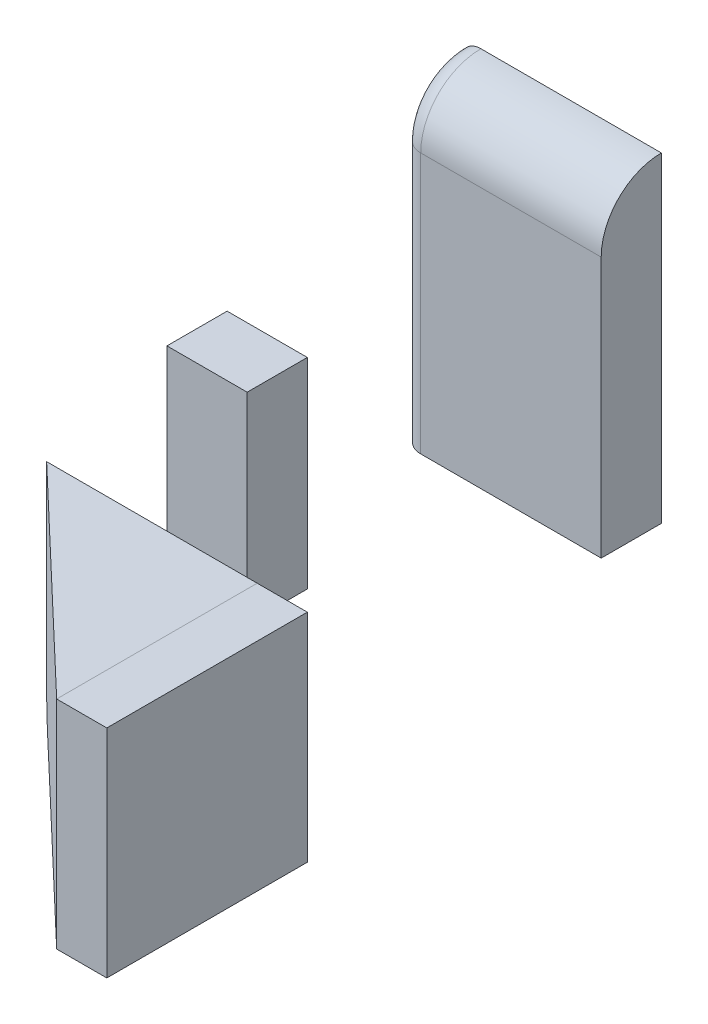
ISO-10303-21;
HEADER;
FILE_DESCRIPTION(('STEP AP214'),'2;1');
FILE_NAME('part.step','',(''),(''),'','','');
FILE_SCHEMA(('AUTOMOTIVE_DESIGN { 1 0 10303 214 1 1 1 1 }'));
ENDSEC;
DATA;
#1=APPLICATION_CONTEXT('core data for automotive mechanical design processes');
#2=APPLICATION_PROTOCOL_DEFINITION('international standard','automotive_design',2000,#1);
#3=PRODUCT_CONTEXT('',#1,'mechanical');
#4=PRODUCT('Part','Part','',(#3));
#5=PRODUCT_RELATED_PRODUCT_CATEGORY('part','',(#4));
#6=PRODUCT_DEFINITION_FORMATION('','',#4);
#7=PRODUCT_DEFINITION_CONTEXT('part definition',#1,'design');
#8=PRODUCT_DEFINITION('design','',#6,#7);
#9=PRODUCT_DEFINITION_SHAPE('','',#8);
#10=(LENGTH_UNIT() NAMED_UNIT(*) SI_UNIT(.MILLI.,.METRE.));
#11=(NAMED_UNIT(*) PLANE_ANGLE_UNIT() SI_UNIT($,.RADIAN.));
#12=(NAMED_UNIT(*) SI_UNIT($,.STERADIAN.) SOLID_ANGLE_UNIT());
#13=UNCERTAINTY_MEASURE_WITH_UNIT(LENGTH_MEASURE(1.E-05),#10,'distance_accuracy_value','');
#14=(GEOMETRIC_REPRESENTATION_CONTEXT(3) GLOBAL_UNCERTAINTY_ASSIGNED_CONTEXT((#13)) GLOBAL_UNIT_ASSIGNED_CONTEXT((#10,
#11,#12)) REPRESENTATION_CONTEXT('',''));
#15=CARTESIAN_POINT('',(0.,0.,0.));
#16=DIRECTION('',(0.,0.,1.));
#17=DIRECTION('',(1.,0.,0.));
#18=AXIS2_PLACEMENT_3D('',#15,#16,#17);
#19=CARTESIAN_POINT('',(5.00000000000057,-10.8,13.));
#20=DIRECTION('',(0.,0.,-1.));
#21=DIRECTION('',(-1.,0.,0.));
#22=AXIS2_PLACEMENT_3D('',#19,#20,#21);
#23=PLANE('',#22);
#24=DIRECTION('',(0.,-1.,0.));
#25=VECTOR('',#24,1.);
#26=CARTESIAN_POINT('',(2.50000000000057,-10.8,13.));
#27=LINE('',#26,#25);
#28=CARTESIAN_POINT('',(2.50000000000057,0.,13.));
#29=VERTEX_POINT('',#28);
#30=CARTESIAN_POINT('',(2.50000000000057,-10.8,13.));
#31=VERTEX_POINT('',#30);
#32=EDGE_CURVE('E113',#29,#31,#27,.T.);
#33=ORIENTED_EDGE('',*,*,#32,.T.);
#34=DIRECTION('',(-1.,0.,0.));
#35=VECTOR('',#34,1.);
#36=CARTESIAN_POINT('',(5.00000000000057,-10.8,13.));
#37=LINE('',#36,#35);
#38=CARTESIAN_POINT('',(5.00000000000057,-10.8,13.));
#39=VERTEX_POINT('',#38);
#40=EDGE_CURVE('E12',#39,#31,#37,.T.);
#41=ORIENTED_EDGE('',*,*,#40,.F.);
#42=DIRECTION('',(0.,-1.,0.));
#43=VECTOR('',#42,1.);
#44=CARTESIAN_POINT('',(5.00000000000057,-10.8,13.));
#45=LINE('',#44,#43);
#46=CARTESIAN_POINT('',(5.00000000000057,0.,13.));
#47=VERTEX_POINT('',#46);
#48=EDGE_CURVE('E101',#47,#39,#45,.T.);
#49=ORIENTED_EDGE('',*,*,#48,.F.);
#50=DIRECTION('',(-1.,0.,0.));
#51=VECTOR('',#50,1.);
#52=CARTESIAN_POINT('',(5.00000000000057,0.,13.));
#53=LINE('',#52,#51);
#54=EDGE_CURVE('E109',#47,#29,#53,.T.);
#55=ORIENTED_EDGE('',*,*,#54,.T.);
#56=EDGE_LOOP('',(#33,#41,#49,#55));
#57=FACE_BOUND('',#56,.T.);
#58=ADVANCED_FACE('F50',(#57),#23,.F.);
#59=CARTESIAN_POINT('',(5.00000000000057,-10.8,13.));
#60=DIRECTION('',(0.,1.,0.));
#61=DIRECTION('',(0.,0.,1.));
#62=AXIS2_PLACEMENT_3D('',#59,#60,#61);
#63=PLANE('',#62);
#64=DIRECTION('',(0.,0.,-1.));
#65=VECTOR('',#64,1.);
#66=CARTESIAN_POINT('',(2.50000000000057,-10.8,13.));
#67=LINE('',#66,#65);
#68=CARTESIAN_POINT('',(2.50000000000057,-10.8,3.));
#69=VERTEX_POINT('',#68);
#70=EDGE_CURVE('E105',#31,#69,#67,.T.);
#71=ORIENTED_EDGE('',*,*,#70,.T.);
#72=DIRECTION('',(-1.,0.,0.));
#73=VECTOR('',#72,1.);
#74=CARTESIAN_POINT('',(5.00000000000057,-10.8,3.));
#75=LINE('',#74,#73);
#76=CARTESIAN_POINT('',(5.00000000000057,-10.8,3.));
#77=VERTEX_POINT('',#76);
#78=EDGE_CURVE('E58',#77,#69,#75,.T.);
#79=ORIENTED_EDGE('',*,*,#78,.F.);
#80=DIRECTION('',(0.,0.,-1.));
#81=VECTOR('',#80,1.);
#82=CARTESIAN_POINT('',(5.00000000000057,-10.8,13.));
#83=LINE('',#82,#81);
#84=EDGE_CURVE('E96',#39,#77,#83,.T.);
#85=ORIENTED_EDGE('',*,*,#84,.F.);
#86=ORIENTED_EDGE('',*,*,#40,.T.);
#87=EDGE_LOOP('',(#71,#79,#85,#86));
#88=FACE_BOUND('',#87,.T.);
#89=ADVANCED_FACE('F104',(#88),#63,.F.);
#90=CARTESIAN_POINT('',(5.00000000000057,-10.8,3.));
#91=DIRECTION('',(0.,0.,1.));
#92=DIRECTION('',(1.,0.,0.));
#93=AXIS2_PLACEMENT_3D('',#90,#91,#92);
#94=PLANE('',#93);
#95=DIRECTION('',(0.,1.,0.));
#96=VECTOR('',#95,1.);
#97=CARTESIAN_POINT('',(2.50000000000057,-10.8,3.));
#98=LINE('',#97,#96);
#99=CARTESIAN_POINT('',(2.50000000000057,0.,3.));
#100=VERTEX_POINT('',#99);
#101=EDGE_CURVE('E83',#69,#100,#98,.T.);
#102=ORIENTED_EDGE('',*,*,#101,.T.);
#103=DIRECTION('',(-1.,0.,0.));
#104=VECTOR('',#103,1.);
#105=CARTESIAN_POINT('',(5.00000000000057,0.,3.));
#106=LINE('',#105,#104);
#107=CARTESIAN_POINT('',(5.00000000000057,0.,3.));
#108=VERTEX_POINT('',#107);
#109=EDGE_CURVE('E106',#108,#100,#106,.T.);
#110=ORIENTED_EDGE('',*,*,#109,.F.);
#111=DIRECTION('',(0.,1.,0.));
#112=VECTOR('',#111,1.);
#113=CARTESIAN_POINT('',(5.00000000000057,-10.8,3.));
#114=LINE('',#113,#112);
#115=EDGE_CURVE('E99',#77,#108,#114,.T.);
#116=ORIENTED_EDGE('',*,*,#115,.F.);
#117=ORIENTED_EDGE('',*,*,#78,.T.);
#118=EDGE_LOOP('',(#102,#110,#116,#117));
#119=FACE_BOUND('',#118,.T.);
#120=ADVANCED_FACE('F107',(#119),#94,.F.);
#121=CARTESIAN_POINT('',(5.00000000000057,0.,13.));
#122=DIRECTION('',(0.,-1.,0.));
#123=DIRECTION('',(0.,0.,-1.));
#124=AXIS2_PLACEMENT_3D('',#121,#122,#123);
#125=PLANE('',#124);
#126=DIRECTION('',(0.,0.,1.));
#127=VECTOR('',#126,1.);
#128=CARTESIAN_POINT('',(2.50000000000057,0.,13.));
#129=LINE('',#128,#127);
#130=EDGE_CURVE('E89',#100,#29,#129,.T.);
#131=ORIENTED_EDGE('',*,*,#130,.T.);
#132=ORIENTED_EDGE('',*,*,#54,.F.);
#133=DIRECTION('',(0.,0.,1.));
#134=VECTOR('',#133,1.);
#135=CARTESIAN_POINT('',(5.00000000000057,0.,13.));
#136=LINE('',#135,#134);
#137=EDGE_CURVE('E66',#108,#47,#136,.T.);
#138=ORIENTED_EDGE('',*,*,#137,.F.);
#139=ORIENTED_EDGE('',*,*,#109,.T.);
#140=EDGE_LOOP('',(#131,#132,#138,#139));
#141=FACE_BOUND('',#140,.T.);
#142=ADVANCED_FACE('F120',(#141),#125,.F.);
#143=CARTESIAN_POINT('',(5.00000000000057,0.,0.));
#144=DIRECTION('',(-1.,0.,0.));
#145=DIRECTION('',(0.,0.,1.));
#146=AXIS2_PLACEMENT_3D('',#143,#144,#145);
#147=PLANE('',#146);
#148=ORIENTED_EDGE('',*,*,#48,.T.);
#149=ORIENTED_EDGE('',*,*,#84,.T.);
#150=ORIENTED_EDGE('',*,*,#115,.T.);
#151=ORIENTED_EDGE('',*,*,#137,.T.);
#152=EDGE_LOOP('',(#148,#149,#150,#151));
#153=FACE_BOUND('',#152,.T.);
#154=ADVANCED_FACE('F97',(#153),#147,.F.);
#155=CARTESIAN_POINT('',(2.50000000000057,0.,0.));
#156=DIRECTION('',(-1.,0.,0.));
#157=DIRECTION('',(0.,0.,1.));
#158=AXIS2_PLACEMENT_3D('',#155,#156,#157);
#159=PLANE('',#158);
#160=ORIENTED_EDGE('',*,*,#32,.F.);
#161=ORIENTED_EDGE('',*,*,#130,.F.);
#162=ORIENTED_EDGE('',*,*,#101,.F.);
#163=ORIENTED_EDGE('',*,*,#70,.F.);
#164=EDGE_LOOP('',(#160,#161,#162,#163));
#165=FACE_BOUND('',#164,.T.);
#166=ADVANCED_FACE('F123',(#165),#159,.T.);
#167=CLOSED_SHELL('',(#58,#89,#120,#142,#154,#166));
#168=MANIFOLD_SOLID_BREP('B2',#167);
#169=CARTESIAN_POINT('',(0.,-10.8,3.));
#170=DIRECTION('',(0.,0.,1.));
#171=DIRECTION('',(1.,0.,0.));
#172=AXIS2_PLACEMENT_3D('',#169,#170,#171);
#173=PLANE('',#172);
#174=DIRECTION('',(0.,1.,0.));
#175=VECTOR('',#174,1.);
#176=CARTESIAN_POINT('',(2.50000000000057,-10.8,3.));
#177=LINE('',#176,#175);
#178=CARTESIAN_POINT('',(2.50000000000057,-9.8,3.));
#179=VERTEX_POINT('',#178);
#180=CARTESIAN_POINT('',(2.50000000000057,0.,3.));
#181=VERTEX_POINT('',#180);
#182=EDGE_CURVE('E240',#179,#181,#177,.T.);
#183=ORIENTED_EDGE('',*,*,#182,.F.);
#184=DIRECTION('',(1.,0.,0.));
#185=VECTOR('',#184,1.);
#186=CARTESIAN_POINT('',(0.,-9.8,3.));
#187=LINE('',#186,#185);
#188=CARTESIAN_POINT('',(-7.99999999999943,-9.8,3.));
#189=VERTEX_POINT('',#188);
#190=EDGE_CURVE('E192',#179,#189,#187,.F.);
#191=ORIENTED_EDGE('',*,*,#190,.T.);
#192=DIRECTION('',(0.,1.,0.));
#193=VECTOR('',#192,1.);
#194=CARTESIAN_POINT('',(-7.99999999999943,-10.8,3.));
#195=LINE('',#194,#193);
#196=CARTESIAN_POINT('',(-7.99999999999943,0.,3.));
#197=VERTEX_POINT('',#196);
#198=EDGE_CURVE('E230',#189,#197,#195,.T.);
#199=ORIENTED_EDGE('',*,*,#198,.T.);
#200=DIRECTION('',(1.,0.,0.));
#201=VECTOR('',#200,1.);
#202=CARTESIAN_POINT('',(0.,0.,3.));
#203=LINE('',#202,#201);
#204=EDGE_CURVE('E248',#197,#181,#203,.T.);
#205=ORIENTED_EDGE('',*,*,#204,.T.);
#206=EDGE_LOOP('',(#183,#191,#199,#205));
#207=FACE_BOUND('',#206,.T.);
#208=ADVANCED_FACE('F184',(#207),#173,.F.);
#209=CARTESIAN_POINT('',(2.50000000000057,-10.8,0.));
#210=DIRECTION('',(-1.,0.,0.));
#211=DIRECTION('',(0.,0.,1.));
#212=AXIS2_PLACEMENT_3D('',#209,#210,#211);
#213=PLANE('',#212);
#214=DIRECTION('',(0.,0.,1.));
#215=VECTOR('',#214,1.);
#216=CARTESIAN_POINT('',(2.50000000000057,-10.8,0.));
#217=LINE('',#216,#215);
#218=CARTESIAN_POINT('',(2.50000000000057,-10.8,4.));
#219=VERTEX_POINT('',#218);
#220=CARTESIAN_POINT('',(2.50000000000057,-10.8,13.));
#221=VERTEX_POINT('',#220);
#222=EDGE_CURVE('E223',#219,#221,#217,.T.);
#223=ORIENTED_EDGE('',*,*,#222,.F.);
#224=CARTESIAN_POINT('',(2.50000000000057,-9.8,4.));
#225=DIRECTION('',(-1.,0.,0.));
#226=DIRECTION('',(0.,0.,1.));
#227=AXIS2_PLACEMENT_3D('',#224,#225,#226);
#228=CIRCLE('',#227,1.);
#229=EDGE_CURVE('E206',#219,#179,#228,.F.);
#230=ORIENTED_EDGE('',*,*,#229,.T.);
#231=ORIENTED_EDGE('',*,*,#182,.T.);
#232=DIRECTION('',(0.,0.,1.));
#233=VECTOR('',#232,1.);
#234=CARTESIAN_POINT('',(2.50000000000057,0.,0.));
#235=LINE('',#234,#233);
#236=CARTESIAN_POINT('',(2.50000000000057,0.,13.));
#237=VERTEX_POINT('',#236);
#238=EDGE_CURVE('E236',#181,#237,#235,.T.);
#239=ORIENTED_EDGE('',*,*,#238,.T.);
#240=DIRECTION('',(0.,1.,0.));
#241=VECTOR('',#240,1.);
#242=CARTESIAN_POINT('',(2.50000000000057,-10.8,13.));
#243=LINE('',#242,#241);
#244=EDGE_CURVE('E233',#221,#237,#243,.T.);
#245=ORIENTED_EDGE('',*,*,#244,.F.);
#246=EDGE_LOOP('',(#223,#230,#231,#239,#245));
#247=FACE_BOUND('',#246,.T.);
#248=ADVANCED_FACE('F234',(#247),#213,.F.);
#249=CARTESIAN_POINT('',(-5.30321046373338,-10.8,5.56837098692005));
#250=DIRECTION('',(0.689655172413793,0.,-0.724137931034483));
#251=DIRECTION('',(-0.724137931034483,0.,-0.689655172413793));
#252=AXIS2_PLACEMENT_3D('',#249,#250,#251);
#253=PLANE('',#252);
#254=ORIENTED_EDGE('',*,*,#198,.F.);
#255=CARTESIAN_POINT('',(-6.94999999999943,-9.8,4.));
#256=DIRECTION('',(0.689655172413793,0.,-0.724137931034483));
#257=DIRECTION('',(0.724137931034483,0.,0.689655172413793));
#258=AXIS2_PLACEMENT_3D('',#255,#256,#257);
#259=ELLIPSE('',#258,1.45,1.);
#260=CARTESIAN_POINT('',(-6.94999999999943,-10.8,4.));
#261=VERTEX_POINT('',#260);
#262=EDGE_CURVE('E48',#189,#261,#259,.F.);
#263=ORIENTED_EDGE('',*,*,#262,.T.);
#264=DIRECTION('',(-0.724137931034483,0.,-0.689655172413793));
#265=VECTOR('',#264,1.);
#266=CARTESIAN_POINT('',(-5.30321046373338,-10.8,5.56837098692005));
#267=LINE('',#266,#265);
#268=EDGE_CURVE('E227',#221,#261,#267,.T.);
#269=ORIENTED_EDGE('',*,*,#268,.F.);
#270=ORIENTED_EDGE('',*,*,#244,.T.);
#271=DIRECTION('',(-0.724137931034483,0.,-0.689655172413793));
#272=VECTOR('',#271,1.);
#273=CARTESIAN_POINT('',(-5.30321046373338,0.,5.56837098692005));
#274=LINE('',#273,#272);
#275=EDGE_CURVE('E245',#237,#197,#274,.T.);
#276=ORIENTED_EDGE('',*,*,#275,.T.);
#277=EDGE_LOOP('',(#254,#263,#269,#270,#276));
#278=FACE_BOUND('',#277,.T.);
#279=ADVANCED_FACE('F242',(#278),#253,.F.);
#280=CARTESIAN_POINT('',(0.,-10.8,0.));
#281=DIRECTION('',(0.,1.,0.));
#282=DIRECTION('',(0.,0.,1.));
#283=AXIS2_PLACEMENT_3D('',#280,#281,#282);
#284=PLANE('',#283);
#285=ORIENTED_EDGE('',*,*,#268,.T.);
#286=DIRECTION('',(1.,0.,0.));
#287=VECTOR('',#286,1.);
#288=CARTESIAN_POINT('',(0.,-10.8,4.));
#289=LINE('',#288,#287);
#290=EDGE_CURVE('E229',#261,#219,#289,.T.);
#291=ORIENTED_EDGE('',*,*,#290,.T.);
#292=ORIENTED_EDGE('',*,*,#222,.T.);
#293=EDGE_LOOP('',(#285,#291,#292));
#294=FACE_BOUND('',#293,.T.);
#295=ADVANCED_FACE('F225',(#294),#284,.F.);
#296=CARTESIAN_POINT('',(0.,0.,0.));
#297=DIRECTION('',(0.,1.,0.));
#298=DIRECTION('',(0.,0.,1.));
#299=AXIS2_PLACEMENT_3D('',#296,#297,#298);
#300=PLANE('',#299);
#301=ORIENTED_EDGE('',*,*,#204,.F.);
#302=ORIENTED_EDGE('',*,*,#275,.F.);
#303=ORIENTED_EDGE('',*,*,#238,.F.);
#304=EDGE_LOOP('',(#301,#302,#303));
#305=FACE_BOUND('',#304,.T.);
#306=ADVANCED_FACE('F257',(#305),#300,.T.);
#307=CARTESIAN_POINT('',(0.,-9.8,4.));
#308=DIRECTION('',(1.,0.,0.));
#309=DIRECTION('',(0.,0.,-1.));
#310=AXIS2_PLACEMENT_3D('',#307,#308,#309);
#311=CYLINDRICAL_SURFACE('',#310,1.);
#312=ORIENTED_EDGE('',*,*,#262,.F.);
#313=ORIENTED_EDGE('',*,*,#190,.F.);
#314=ORIENTED_EDGE('',*,*,#229,.F.);
#315=ORIENTED_EDGE('',*,*,#290,.F.);
#316=EDGE_LOOP('',(#312,#313,#314,#315));
#317=FACE_BOUND('',#316,.T.);
#318=ADVANCED_FACE('F186',(#317),#311,.T.);
#319=CLOSED_SHELL('',(#208,#248,#279,#295,#306,#318));
#320=MANIFOLD_SOLID_BREP('B6',#319);
#321=CARTESIAN_POINT('',(-8.00289104401307,-7.99786333009726,-14.6579149010584));
#322=DIRECTION('',(-1.,0.,0.));
#323=DIRECTION('',(0.,0.,1.));
#324=AXIS2_PLACEMENT_3D('',#321,#322,#323);
#325=PLANE('',#324);
#326=DIRECTION('',(0.,0.,-1.));
#327=VECTOR('',#326,1.);
#328=CARTESIAN_POINT('',(-8.00289104401307,-7.99786333009726,-14.6579149010584));
#329=LINE('',#328,#327);
#330=CARTESIAN_POINT('',(-8.00289104401307,-7.99786333009726,-15.6579149010584));
#331=VERTEX_POINT('',#330);
#332=CARTESIAN_POINT('',(-8.00289104401307,-7.99786333009726,-17.6579149010584));
#333=VERTEX_POINT('',#332);
#334=EDGE_CURVE('E386',#331,#333,#329,.T.);
#335=ORIENTED_EDGE('',*,*,#334,.F.);
#336=DIRECTION('',(0.,1.,0.));
#337=VECTOR('',#336,1.);
#338=CARTESIAN_POINT('',(-8.00289104401307,-7.99786333009726,-15.6579149010584));
#339=LINE('',#338,#337);
#340=CARTESIAN_POINT('',(-8.00289104401307,5.00213666990274,-15.6579149010584));
#341=VERTEX_POINT('',#340);
#342=EDGE_CURVE('E406',#331,#341,#339,.T.);
#343=ORIENTED_EDGE('',*,*,#342,.T.);
#344=CARTESIAN_POINT('',(-8.00289104401307,5.00213666990274,-17.6579149010584));
#345=DIRECTION('',(-1.,0.,0.));
#346=DIRECTION('',(0.,0.,1.));
#347=AXIS2_PLACEMENT_3D('',#344,#345,#346);
#348=CIRCLE('',#347,2.);
#349=CARTESIAN_POINT('',(-8.00289104401307,7.00213666990274,-17.6579149010584));
#350=VERTEX_POINT('',#349);
#351=EDGE_CURVE('E404',#341,#350,#348,.T.);
#352=ORIENTED_EDGE('',*,*,#351,.T.);
#353=DIRECTION('',(0.,1.,0.));
#354=VECTOR('',#353,1.);
#355=CARTESIAN_POINT('',(-8.00289104401307,-7.99786333009726,-17.6579149010584));
#356=LINE('',#355,#354);
#357=EDGE_CURVE('E391',#333,#350,#356,.T.);
#358=ORIENTED_EDGE('',*,*,#357,.F.);
#359=EDGE_LOOP('',(#335,#343,#352,#358));
#360=FACE_BOUND('',#359,.T.);
#361=ADVANCED_FACE('F320',(#360),#325,.T.);
#362=CARTESIAN_POINT('',(-8.00289104401307,-7.99786333009726,-14.6579149010584));
#363=DIRECTION('',(0.,1.,0.));
#364=DIRECTION('',(0.,0.,1.));
#365=AXIS2_PLACEMENT_3D('',#362,#363,#364);
#366=PLANE('',#365);
#367=DIRECTION('',(1.,0.,0.));
#368=VECTOR('',#367,1.);
#369=CARTESIAN_POINT('',(-8.00289104401307,-7.99786333009726,-14.6579149010584));
#370=LINE('',#369,#368);
#371=CARTESIAN_POINT('',(-7.00289104401307,-7.99786333009726,-14.6579149010584));
#372=VERTEX_POINT('',#371);
#373=CARTESIAN_POINT('',(1.99710895598693,-7.99786333009726,-14.6579149010584));
#374=VERTEX_POINT('',#373);
#375=EDGE_CURVE('E369',#372,#374,#370,.T.);
#376=ORIENTED_EDGE('',*,*,#375,.F.);
#377=CARTESIAN_POINT('',(-7.00289104401307,-7.99786333009726,-15.6579149010584));
#378=DIRECTION('',(0.,1.,0.));
#379=DIRECTION('',(0.,0.,1.));
#380=AXIS2_PLACEMENT_3D('',#377,#378,#379);
#381=CIRCLE('',#380,1.);
#382=EDGE_CURVE('E410',#372,#331,#381,.F.);
#383=ORIENTED_EDGE('',*,*,#382,.T.);
#384=ORIENTED_EDGE('',*,*,#334,.T.);
#385=DIRECTION('',(1.,0.,0.));
#386=VECTOR('',#385,1.);
#387=CARTESIAN_POINT('',(-8.00289104401307,-7.99786333009726,-17.6579149010584));
#388=LINE('',#387,#386);
#389=CARTESIAN_POINT('',(1.99710895598693,-7.99786333009726,-17.6579149010584));
#390=VERTEX_POINT('',#389);
#391=EDGE_CURVE('E382',#333,#390,#388,.T.);
#392=ORIENTED_EDGE('',*,*,#391,.T.);
#393=DIRECTION('',(0.,0.,-1.));
#394=VECTOR('',#393,1.);
#395=CARTESIAN_POINT('',(1.99710895598693,-7.99786333009726,-14.6579149010584));
#396=LINE('',#395,#394);
#397=EDGE_CURVE('E377',#374,#390,#396,.T.);
#398=ORIENTED_EDGE('',*,*,#397,.F.);
#399=EDGE_LOOP('',(#376,#383,#384,#392,#398));
#400=FACE_BOUND('',#399,.T.);
#401=ADVANCED_FACE('F380',(#400),#366,.F.);
#402=CARTESIAN_POINT('',(1.99710895598693,-7.99786333009726,-14.6579149010584));
#403=DIRECTION('',(-1.,0.,0.));
#404=DIRECTION('',(0.,0.,1.));
#405=AXIS2_PLACEMENT_3D('',#402,#403,#404);
#406=PLANE('',#405);
#407=DIRECTION('',(0.,1.,0.));
#408=VECTOR('',#407,1.);
#409=CARTESIAN_POINT('',(1.99710895598693,-7.99786333009726,-17.6579149010584));
#410=LINE('',#409,#408);
#411=CARTESIAN_POINT('',(1.99710895598693,8.00213666990274,-17.6579149010584));
#412=VERTEX_POINT('',#411);
#413=EDGE_CURVE('E397',#390,#412,#410,.T.);
#414=ORIENTED_EDGE('',*,*,#413,.T.);
#415=CARTESIAN_POINT('',(1.99710895598693,5.00213666990274,-17.6579149010584));
#416=DIRECTION('',(-1.,0.,0.));
#417=DIRECTION('',(0.,0.,1.));
#418=AXIS2_PLACEMENT_3D('',#415,#416,#417);
#419=CIRCLE('',#418,3.);
#420=CARTESIAN_POINT('',(1.99710895598693,5.00213666990274,-14.6579149010584));
#421=VERTEX_POINT('',#420);
#422=EDGE_CURVE('E390',#412,#421,#419,.F.);
#423=ORIENTED_EDGE('',*,*,#422,.T.);
#424=DIRECTION('',(0.,1.,0.));
#425=VECTOR('',#424,1.);
#426=CARTESIAN_POINT('',(1.99710895598693,-7.99786333009726,-14.6579149010584));
#427=LINE('',#426,#425);
#428=EDGE_CURVE('E373',#374,#421,#427,.T.);
#429=ORIENTED_EDGE('',*,*,#428,.F.);
#430=ORIENTED_EDGE('',*,*,#397,.T.);
#431=EDGE_LOOP('',(#414,#423,#429,#430));
#432=FACE_BOUND('',#431,.T.);
#433=ADVANCED_FACE('F388',(#432),#406,.F.);
#434=CARTESIAN_POINT('',(0.,0.,-14.6579149010584));
#435=DIRECTION('',(0.,0.,1.));
#436=DIRECTION('',(1.,0.,0.));
#437=AXIS2_PLACEMENT_3D('',#434,#435,#436);
#438=PLANE('',#437);
#439=DIRECTION('',(1.,0.,0.));
#440=VECTOR('',#439,1.);
#441=CARTESIAN_POINT('',(0.,5.00213666990274,-14.6579149010584));
#442=LINE('',#441,#440);
#443=CARTESIAN_POINT('',(-7.00289104401307,5.00213666990274,-14.6579149010584));
#444=VERTEX_POINT('',#443);
#445=EDGE_CURVE('E402',#421,#444,#442,.F.);
#446=ORIENTED_EDGE('',*,*,#445,.T.);
#447=DIRECTION('',(0.,1.,0.));
#448=VECTOR('',#447,1.);
#449=CARTESIAN_POINT('',(-7.00289104401307,0.,-14.6579149010584));
#450=LINE('',#449,#448);
#451=EDGE_CURVE('E343',#444,#372,#450,.F.);
#452=ORIENTED_EDGE('',*,*,#451,.T.);
#453=ORIENTED_EDGE('',*,*,#375,.T.);
#454=ORIENTED_EDGE('',*,*,#428,.T.);
#455=EDGE_LOOP('',(#446,#452,#453,#454));
#456=FACE_BOUND('',#455,.T.);
#457=ADVANCED_FACE('F371',(#456),#438,.T.);
#458=CARTESIAN_POINT('',(0.,0.,-17.6579149010584));
#459=DIRECTION('',(0.,0.,1.));
#460=DIRECTION('',(1.,0.,0.));
#461=AXIS2_PLACEMENT_3D('',#458,#459,#460);
#462=PLANE('',#461);
#463=ORIENTED_EDGE('',*,*,#357,.T.);
#464=CARTESIAN_POINT('',(-7.00289104401307,7.00213666990274,-17.6579149010584));
#465=DIRECTION('',(0.,0.,1.));
#466=DIRECTION('',(1.,0.,0.));
#467=AXIS2_PLACEMENT_3D('',#464,#465,#466);
#468=CIRCLE('',#467,1.);
#469=CARTESIAN_POINT('',(-7.00289104401307,8.00213666990274,-17.6579149010584));
#470=VERTEX_POINT('',#469);
#471=EDGE_CURVE('E329',#350,#470,#468,.F.);
#472=ORIENTED_EDGE('',*,*,#471,.T.);
#473=DIRECTION('',(1.,0.,0.));
#474=VECTOR('',#473,1.);
#475=CARTESIAN_POINT('',(-8.00289104401307,8.00213666990274,-17.6579149010584));
#476=LINE('',#475,#474);
#477=EDGE_CURVE('E395',#470,#412,#476,.T.);
#478=ORIENTED_EDGE('',*,*,#477,.T.);
#479=ORIENTED_EDGE('',*,*,#413,.F.);
#480=ORIENTED_EDGE('',*,*,#391,.F.);
#481=EDGE_LOOP('',(#463,#472,#478,#479,#480));
#482=FACE_BOUND('',#481,.T.);
#483=ADVANCED_FACE('F422',(#482),#462,.F.);
#484=CARTESIAN_POINT('',(-8.00289104401307,5.00213666990274,-17.6579149010584));
#485=DIRECTION('',(1.,0.,0.));
#486=DIRECTION('',(0.,0.,-1.));
#487=AXIS2_PLACEMENT_3D('',#484,#485,#486);
#488=CYLINDRICAL_SURFACE('',#487,3.);
#489=ORIENTED_EDGE('',*,*,#477,.F.);
#490=CARTESIAN_POINT('',(-7.00289104401307,5.00213666990274,-17.6579149010584));
#491=DIRECTION('',(-1.,0.,0.));
#492=DIRECTION('',(0.,0.,1.));
#493=AXIS2_PLACEMENT_3D('',#490,#491,#492);
#494=CIRCLE('',#493,3.);
#495=EDGE_CURVE('E182',#470,#444,#494,.F.);
#496=ORIENTED_EDGE('',*,*,#495,.T.);
#497=ORIENTED_EDGE('',*,*,#445,.F.);
#498=ORIENTED_EDGE('',*,*,#422,.F.);
#499=EDGE_LOOP('',(#489,#496,#497,#498));
#500=FACE_BOUND('',#499,.T.);
#501=ADVANCED_FACE('F424',(#500),#488,.T.);
#502=CARTESIAN_POINT('',(-7.00289104401307,5.00213666990274,-17.6579149010584));
#503=DIRECTION('',(-1.,0.,0.));
#504=DIRECTION('',(0.,0.,1.));
#505=AXIS2_PLACEMENT_3D('',#502,#503,#504);
#506=TOROIDAL_SURFACE('',#505,2.,1.);
#507=ORIENTED_EDGE('',*,*,#471,.F.);
#508=ORIENTED_EDGE('',*,*,#351,.F.);
#509=CARTESIAN_POINT('',(-7.00289104401307,5.00213666990274,-15.6579149010584));
#510=DIRECTION('',(0.,-1.,0.));
#511=DIRECTION('',(0.,0.,-1.));
#512=AXIS2_PLACEMENT_3D('',#509,#510,#511);
#513=CIRCLE('',#512,1.);
#514=EDGE_CURVE('E324',#444,#341,#513,.T.);
#515=ORIENTED_EDGE('',*,*,#514,.F.);
#516=ORIENTED_EDGE('',*,*,#495,.F.);
#517=EDGE_LOOP('',(#507,#508,#515,#516));
#518=FACE_BOUND('',#517,.T.);
#519=ADVANCED_FACE('F322',(#518),#506,.T.);
#520=CARTESIAN_POINT('',(-7.00289104401307,-7.99786333009726,-15.6579149010584));
#521=DIRECTION('',(0.,1.,0.));
#522=DIRECTION('',(0.,0.,1.));
#523=AXIS2_PLACEMENT_3D('',#520,#521,#522);
#524=CYLINDRICAL_SURFACE('',#523,1.);
#525=ORIENTED_EDGE('',*,*,#382,.F.);
#526=ORIENTED_EDGE('',*,*,#451,.F.);
#527=ORIENTED_EDGE('',*,*,#514,.T.);
#528=ORIENTED_EDGE('',*,*,#342,.F.);
#529=EDGE_LOOP('',(#525,#526,#527,#528));
#530=FACE_BOUND('',#529,.T.);
#531=ADVANCED_FACE('F417',(#530),#524,.T.);
#532=CLOSED_SHELL('',(#361,#401,#433,#457,#483,#501,#519,#531));
#533=MANIFOLD_SOLID_BREP('B42',#532);
#534=CARTESIAN_POINT('',(-4.99999999999922,-4.99999999999999,-3.));
#535=DIRECTION('',(0.,-1.,0.));
#536=DIRECTION('',(1.,0.,0.));
#537=AXIS2_PLACEMENT_3D('',#534,#535,#536);
#538=PLANE('',#537);
#539=DIRECTION('',(1.,0.,0.));
#540=VECTOR('',#539,1.);
#541=CARTESIAN_POINT('',(-4.99999999999922,-4.99999999999999,0.));
#542=LINE('',#541,#540);
#543=CARTESIAN_POINT('',(-4.99999999999922,-4.99999999999999,0.));
#544=VERTEX_POINT('',#543);
#545=CARTESIAN_POINT('',(-0.999999999999219,-4.99999999999999,0.));
#546=VERTEX_POINT('',#545);
#547=EDGE_CURVE('E556',#544,#546,#542,.T.);
#548=ORIENTED_EDGE('',*,*,#547,.F.);
#549=DIRECTION('',(0.,0.,1.));
#550=VECTOR('',#549,1.);
#551=CARTESIAN_POINT('',(-4.99999999999922,-4.99999999999999,-3.));
#552=LINE('',#551,#550);
#553=CARTESIAN_POINT('',(-4.99999999999922,-4.99999999999999,-3.));
#554=VERTEX_POINT('',#553);
#555=EDGE_CURVE('E318',#554,#544,#552,.T.);
#556=ORIENTED_EDGE('',*,*,#555,.F.);
#557=DIRECTION('',(1.,0.,0.));
#558=VECTOR('',#557,1.);
#559=CARTESIAN_POINT('',(-4.99999999999922,-4.99999999999999,-3.));
#560=LINE('',#559,#558);
#561=CARTESIAN_POINT('',(-0.999999999999219,-4.99999999999999,-3.));
#562=VERTEX_POINT('',#561);
#563=EDGE_CURVE('E550',#554,#562,#560,.T.);
#564=ORIENTED_EDGE('',*,*,#563,.T.);
#565=DIRECTION('',(0.,0.,1.));
#566=VECTOR('',#565,1.);
#567=CARTESIAN_POINT('',(-0.999999999999219,-4.99999999999999,-3.));
#568=LINE('',#567,#566);
#569=EDGE_CURVE('E495',#562,#546,#568,.T.);
#570=ORIENTED_EDGE('',*,*,#569,.T.);
#571=EDGE_LOOP('',(#548,#556,#564,#570));
#572=FACE_BOUND('',#571,.T.);
#573=ADVANCED_FACE('F492',(#572),#538,.T.);
#574=CARTESIAN_POINT('',(-4.99999999999921,5.00000000000001,-3.));
#575=DIRECTION('',(-1.,0.,0.));
#576=DIRECTION('',(0.,-1.,0.));
#577=AXIS2_PLACEMENT_3D('',#574,#575,#576);
#578=PLANE('',#577);
#579=DIRECTION('',(0.,-1.,0.));
#580=VECTOR('',#579,1.);
#581=CARTESIAN_POINT('',(-4.99999999999921,5.00000000000001,0.));
#582=LINE('',#581,#580);
#583=CARTESIAN_POINT('',(-4.99999999999921,5.00000000000001,0.));
#584=VERTEX_POINT('',#583);
#585=EDGE_CURVE('E552',#584,#544,#582,.T.);
#586=ORIENTED_EDGE('',*,*,#585,.F.);
#587=DIRECTION('',(0.,0.,1.));
#588=VECTOR('',#587,1.);
#589=CARTESIAN_POINT('',(-4.99999999999921,5.00000000000001,-3.));
#590=LINE('',#589,#588);
#591=CARTESIAN_POINT('',(-4.99999999999921,5.00000000000001,-3.));
#592=VERTEX_POINT('',#591);
#593=EDGE_CURVE('E501',#592,#584,#590,.T.);
#594=ORIENTED_EDGE('',*,*,#593,.F.);
#595=DIRECTION('',(0.,-1.,0.));
#596=VECTOR('',#595,1.);
#597=CARTESIAN_POINT('',(-4.99999999999921,5.00000000000001,-3.));
#598=LINE('',#597,#596);
#599=EDGE_CURVE('E547',#592,#554,#598,.T.);
#600=ORIENTED_EDGE('',*,*,#599,.T.);
#601=ORIENTED_EDGE('',*,*,#555,.T.);
#602=EDGE_LOOP('',(#586,#594,#600,#601));
#603=FACE_BOUND('',#602,.T.);
#604=ADVANCED_FACE('F566',(#603),#578,.T.);
#605=CARTESIAN_POINT('',(-0.999999999999214,5.00000000000001,-3.));
#606=DIRECTION('',(0.,1.,0.));
#607=DIRECTION('',(-1.,0.,0.));
#608=AXIS2_PLACEMENT_3D('',#605,#606,#607);
#609=PLANE('',#608);
#610=DIRECTION('',(-1.,0.,0.));
#611=VECTOR('',#610,1.);
#612=CARTESIAN_POINT('',(-0.999999999999214,5.00000000000001,0.));
#613=LINE('',#612,#611);
#614=CARTESIAN_POINT('',(-0.999999999999214,5.00000000000001,0.));
#615=VERTEX_POINT('',#614);
#616=EDGE_CURVE('E542',#615,#584,#613,.T.);
#617=ORIENTED_EDGE('',*,*,#616,.F.);
#618=DIRECTION('',(0.,0.,1.));
#619=VECTOR('',#618,1.);
#620=CARTESIAN_POINT('',(-0.999999999999214,5.00000000000001,-3.));
#621=LINE('',#620,#619);
#622=CARTESIAN_POINT('',(-0.999999999999214,5.00000000000001,-3.));
#623=VERTEX_POINT('',#622);
#624=EDGE_CURVE('E537',#623,#615,#621,.T.);
#625=ORIENTED_EDGE('',*,*,#624,.F.);
#626=DIRECTION('',(-1.,0.,0.));
#627=VECTOR('',#626,1.);
#628=CARTESIAN_POINT('',(-0.999999999999214,5.00000000000001,-3.));
#629=LINE('',#628,#627);
#630=EDGE_CURVE('E540',#623,#592,#629,.T.);
#631=ORIENTED_EDGE('',*,*,#630,.T.);
#632=ORIENTED_EDGE('',*,*,#593,.T.);
#633=EDGE_LOOP('',(#617,#625,#631,#632));
#634=FACE_BOUND('',#633,.T.);
#635=ADVANCED_FACE('F539',(#634),#609,.T.);
#636=CARTESIAN_POINT('',(-0.999999999999219,-4.99999999999999,-3.));
#637=DIRECTION('',(1.,0.,0.));
#638=DIRECTION('',(0.,1.,0.));
#639=AXIS2_PLACEMENT_3D('',#636,#637,#638);
#640=PLANE('',#639);
#641=DIRECTION('',(0.,1.,0.));
#642=VECTOR('',#641,1.);
#643=CARTESIAN_POINT('',(-0.999999999999219,-4.99999999999999,0.));
#644=LINE('',#643,#642);
#645=EDGE_CURVE('E559',#546,#615,#644,.T.);
#646=ORIENTED_EDGE('',*,*,#645,.F.);
#647=ORIENTED_EDGE('',*,*,#569,.F.);
#648=DIRECTION('',(0.,1.,0.));
#649=VECTOR('',#648,1.);
#650=CARTESIAN_POINT('',(-0.999999999999219,-4.99999999999999,-3.));
#651=LINE('',#650,#649);
#652=EDGE_CURVE('E546',#562,#623,#651,.T.);
#653=ORIENTED_EDGE('',*,*,#652,.T.);
#654=ORIENTED_EDGE('',*,*,#624,.T.);
#655=EDGE_LOOP('',(#646,#647,#653,#654));
#656=FACE_BOUND('',#655,.T.);
#657=ADVANCED_FACE('F549',(#656),#640,.T.);
#658=CARTESIAN_POINT('',(0.,0.,-3.));
#659=DIRECTION('',(0.,0.,1.));
#660=DIRECTION('',(1.,0.,0.));
#661=AXIS2_PLACEMENT_3D('',#658,#659,#660);
#662=PLANE('',#661);
#663=ORIENTED_EDGE('',*,*,#563,.F.);
#664=ORIENTED_EDGE('',*,*,#599,.F.);
#665=ORIENTED_EDGE('',*,*,#630,.F.);
#666=ORIENTED_EDGE('',*,*,#652,.F.);
#667=EDGE_LOOP('',(#663,#664,#665,#666));
#668=FACE_BOUND('',#667,.T.);
#669=ADVANCED_FACE('F545',(#668),#662,.F.);
#670=CARTESIAN_POINT('',(0.,0.,0.));
#671=DIRECTION('',(0.,0.,1.));
#672=DIRECTION('',(1.,0.,0.));
#673=AXIS2_PLACEMENT_3D('',#670,#671,#672);
#674=PLANE('',#673);
#675=ORIENTED_EDGE('',*,*,#547,.T.);
#676=ORIENTED_EDGE('',*,*,#645,.T.);
#677=ORIENTED_EDGE('',*,*,#616,.T.);
#678=ORIENTED_EDGE('',*,*,#585,.T.);
#679=EDGE_LOOP('',(#675,#676,#677,#678));
#680=FACE_BOUND('',#679,.T.);
#681=ADVANCED_FACE('F565',(#680),#674,.T.);
#682=CLOSED_SHELL('',(#573,#604,#635,#657,#669,#681));
#683=MANIFOLD_SOLID_BREP('B176',#682);
#684=ADVANCED_BREP_SHAPE_REPRESENTATION('',(#18,#168,#320,#533,#683),#14);
#685=SHAPE_DEFINITION_REPRESENTATION(#9,#684);
ENDSEC;
END-ISO-10303-21;
